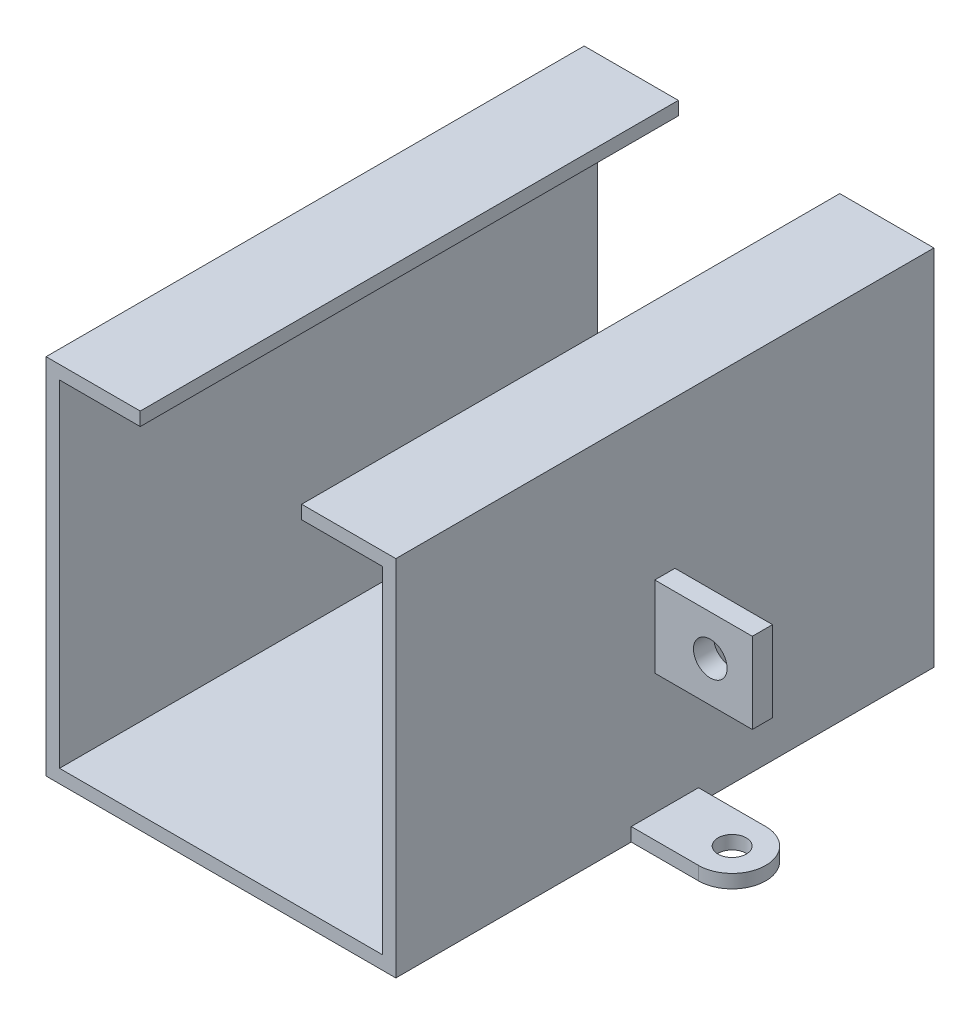
ISO-10303-21;
HEADER;
FILE_DESCRIPTION(('STEP AP214'),'2;1');
FILE_NAME('part.step','',(''),(''),'','','');
FILE_SCHEMA(('AUTOMOTIVE_DESIGN { 1 0 10303 214 1 1 1 1 }'));
ENDSEC;
DATA;
#1=APPLICATION_CONTEXT('core data for automotive mechanical design processes');
#2=APPLICATION_PROTOCOL_DEFINITION('international standard','automotive_design',2000,#1);
#3=PRODUCT_CONTEXT('',#1,'mechanical');
#4=PRODUCT('Part','Part','',(#3));
#5=PRODUCT_RELATED_PRODUCT_CATEGORY('part','',(#4));
#6=PRODUCT_DEFINITION_FORMATION('','',#4);
#7=PRODUCT_DEFINITION_CONTEXT('part definition',#1,'design');
#8=PRODUCT_DEFINITION('design','',#6,#7);
#9=PRODUCT_DEFINITION_SHAPE('','',#8);
#10=(LENGTH_UNIT() NAMED_UNIT(*) SI_UNIT(.MILLI.,.METRE.));
#11=(NAMED_UNIT(*) PLANE_ANGLE_UNIT() SI_UNIT($,.RADIAN.));
#12=(NAMED_UNIT(*) SI_UNIT($,.STERADIAN.) SOLID_ANGLE_UNIT());
#13=UNCERTAINTY_MEASURE_WITH_UNIT(LENGTH_MEASURE(1.E-05),#10,'distance_accuracy_value','');
#14=(GEOMETRIC_REPRESENTATION_CONTEXT(3) GLOBAL_UNCERTAINTY_ASSIGNED_CONTEXT((#13)) GLOBAL_UNIT_ASSIGNED_CONTEXT((#10,
#11,#12)) REPRESENTATION_CONTEXT('',''));
#15=CARTESIAN_POINT('',(0.,0.,0.));
#16=DIRECTION('',(0.,0.,1.));
#17=DIRECTION('',(1.,0.,0.));
#18=AXIS2_PLACEMENT_3D('',#15,#16,#17);
#19=CARTESIAN_POINT('',(50.,-1.99999999999999,80.));
#20=DIRECTION('',(-1.,0.,0.));
#21=DIRECTION('',(0.,0.,1.));
#22=AXIS2_PLACEMENT_3D('',#19,#20,#21);
#23=PLANE('',#22);
#24=DIRECTION('',(0.,-1.,0.));
#25=VECTOR('',#24,1.);
#26=CARTESIAN_POINT('',(50.,0.,45.));
#27=LINE('',#26,#25);
#28=CARTESIAN_POINT('',(50.,0.,45.));
#29=VERTEX_POINT('',#28);
#30=CARTESIAN_POINT('',(50.,-1.99999999999999,45.));
#31=VERTEX_POINT('',#30);
#32=EDGE_CURVE('E345',#29,#31,#27,.T.);
#33=ORIENTED_EDGE('',*,*,#32,.F.);
#34=DIRECTION('',(0.,0.,1.));
#35=VECTOR('',#34,1.);
#36=CARTESIAN_POINT('',(50.,0.,0.));
#37=LINE('',#36,#35);
#38=CARTESIAN_POINT('',(50.,0.,35.));
#39=VERTEX_POINT('',#38);
#40=EDGE_CURVE('E324',#39,#29,#37,.T.);
#41=ORIENTED_EDGE('',*,*,#40,.F.);
#42=DIRECTION('',(0.,-1.,0.));
#43=VECTOR('',#42,1.);
#44=CARTESIAN_POINT('',(50.,0.,35.));
#45=LINE('',#44,#43);
#46=CARTESIAN_POINT('',(50.,-1.99999999999999,35.));
#47=VERTEX_POINT('',#46);
#48=EDGE_CURVE('E342',#39,#47,#45,.T.);
#49=ORIENTED_EDGE('',*,*,#48,.T.);
#50=DIRECTION('',(0.,0.,-1.));
#51=VECTOR('',#50,1.);
#52=CARTESIAN_POINT('',(50.,-1.99999999999999,80.));
#53=LINE('',#52,#51);
#54=CARTESIAN_POINT('',(50.,-1.99999999999999,0.));
#55=VERTEX_POINT('',#54);
#56=EDGE_CURVE('E416',#47,#55,#53,.T.);
#57=ORIENTED_EDGE('',*,*,#56,.T.);
#58=DIRECTION('',(0.,1.,0.));
#59=VECTOR('',#58,1.);
#60=CARTESIAN_POINT('',(50.,-1.99999999999999,0.));
#61=LINE('',#60,#59);
#62=CARTESIAN_POINT('',(50.,52.,0.));
#63=VERTEX_POINT('',#62);
#64=EDGE_CURVE('E393',#55,#63,#61,.T.);
#65=ORIENTED_EDGE('',*,*,#64,.T.);
#66=DIRECTION('',(0.,0.,-1.));
#67=VECTOR('',#66,1.);
#68=CARTESIAN_POINT('',(50.,52.,80.));
#69=LINE('',#68,#67);
#70=CARTESIAN_POINT('',(50.,52.,80.));
#71=VERTEX_POINT('',#70);
#72=EDGE_CURVE('E413',#71,#63,#69,.T.);
#73=ORIENTED_EDGE('',*,*,#72,.F.);
#74=DIRECTION('',(0.,1.,0.));
#75=VECTOR('',#74,1.);
#76=CARTESIAN_POINT('',(50.,-1.99999999999999,80.));
#77=LINE('',#76,#75);
#78=CARTESIAN_POINT('',(50.,-1.99999999999999,80.));
#79=VERTEX_POINT('',#78);
#80=EDGE_CURVE('E365',#79,#71,#77,.T.);
#81=ORIENTED_EDGE('',*,*,#80,.F.);
#82=EDGE_CURVE('E417',#79,#31,#53,.T.);
#83=ORIENTED_EDGE('',*,*,#82,.T.);
#84=EDGE_LOOP('',(#33,#41,#49,#57,#65,#73,#81,#83));
#85=FACE_BOUND('',#84,.T.);
#86=DIRECTION('',(0.,0.,1.));
#87=VECTOR('',#86,1.);
#88=CARTESIAN_POINT('',(50.,30.,0.));
#89=LINE('',#88,#87);
#90=CARTESIAN_POINT('',(50.,30.,38.5));
#91=VERTEX_POINT('',#90);
#92=CARTESIAN_POINT('',(50.,30.,41.5));
#93=VERTEX_POINT('',#92);
#94=EDGE_CURVE('E243',#91,#93,#89,.T.);
#95=ORIENTED_EDGE('',*,*,#94,.F.);
#96=DIRECTION('',(0.,1.,0.));
#97=VECTOR('',#96,1.);
#98=CARTESIAN_POINT('',(50.,0.,38.5));
#99=LINE('',#98,#97);
#100=CARTESIAN_POINT('',(50.,18.,38.5));
#101=VERTEX_POINT('',#100);
#102=EDGE_CURVE('E240',#101,#91,#99,.T.);
#103=ORIENTED_EDGE('',*,*,#102,.F.);
#104=DIRECTION('',(0.,0.,-1.));
#105=VECTOR('',#104,1.);
#106=CARTESIAN_POINT('',(50.,18.,0.));
#107=LINE('',#106,#105);
#108=CARTESIAN_POINT('',(50.,18.,41.5));
#109=VERTEX_POINT('',#108);
#110=EDGE_CURVE('E58',#109,#101,#107,.T.);
#111=ORIENTED_EDGE('',*,*,#110,.F.);
#112=DIRECTION('',(0.,-1.,0.));
#113=VECTOR('',#112,1.);
#114=CARTESIAN_POINT('',(50.,0.,41.5));
#115=LINE('',#114,#113);
#116=EDGE_CURVE('E53',#93,#109,#115,.T.);
#117=ORIENTED_EDGE('',*,*,#116,.F.);
#118=EDGE_LOOP('',(#95,#103,#111,#117));
#119=FACE_BOUND('',#118,.T.);
#120=ADVANCED_FACE('F38',(#85,#119),#23,.F.);
#121=CARTESIAN_POINT('',(-2.,25.,80.));
#122=DIRECTION('',(1.,0.,0.));
#123=DIRECTION('',(0.,1.,0.));
#124=AXIS2_PLACEMENT_3D('',#121,#122,#123);
#125=PLANE('',#124);
#126=DIRECTION('',(0.,0.,1.));
#127=VECTOR('',#126,1.);
#128=CARTESIAN_POINT('',(-2.,30.,0.));
#129=LINE('',#128,#127);
#130=CARTESIAN_POINT('',(-2.,30.,38.5));
#131=VERTEX_POINT('',#130);
#132=CARTESIAN_POINT('',(-2.,30.,41.5));
#133=VERTEX_POINT('',#132);
#134=EDGE_CURVE('E247',#131,#133,#129,.T.);
#135=ORIENTED_EDGE('',*,*,#134,.T.);
#136=DIRECTION('',(0.,-1.,0.));
#137=VECTOR('',#136,1.);
#138=CARTESIAN_POINT('',(-2.,0.,41.5));
#139=LINE('',#138,#137);
#140=CARTESIAN_POINT('',(-2.,18.,41.5));
#141=VERTEX_POINT('',#140);
#142=EDGE_CURVE('E244',#133,#141,#139,.T.);
#143=ORIENTED_EDGE('',*,*,#142,.T.);
#144=DIRECTION('',(0.,0.,-1.));
#145=VECTOR('',#144,1.);
#146=CARTESIAN_POINT('',(-2.,18.,0.));
#147=LINE('',#146,#145);
#148=CARTESIAN_POINT('',(-2.,18.,38.5));
#149=VERTEX_POINT('',#148);
#150=EDGE_CURVE('E257',#141,#149,#147,.T.);
#151=ORIENTED_EDGE('',*,*,#150,.T.);
#152=DIRECTION('',(0.,1.,0.));
#153=VECTOR('',#152,1.);
#154=CARTESIAN_POINT('',(-2.,0.,38.5));
#155=LINE('',#154,#153);
#156=EDGE_CURVE('E269',#149,#131,#155,.T.);
#157=ORIENTED_EDGE('',*,*,#156,.T.);
#158=EDGE_LOOP('',(#135,#143,#151,#157));
#159=FACE_BOUND('',#158,.T.);
#160=DIRECTION('',(0.,-1.,0.));
#161=VECTOR('',#160,1.);
#162=CARTESIAN_POINT('',(-2.,0.,35.));
#163=LINE('',#162,#161);
#164=CARTESIAN_POINT('',(-2.,0.,35.));
#165=VERTEX_POINT('',#164);
#166=CARTESIAN_POINT('',(-2.,-1.99999999999999,35.));
#167=VERTEX_POINT('',#166);
#168=EDGE_CURVE('E312',#165,#167,#163,.T.);
#169=ORIENTED_EDGE('',*,*,#168,.F.);
#170=DIRECTION('',(0.,0.,-1.));
#171=VECTOR('',#170,1.);
#172=CARTESIAN_POINT('',(-2.,0.,0.));
#173=LINE('',#172,#171);
#174=CARTESIAN_POINT('',(-2.,0.,45.));
#175=VERTEX_POINT('',#174);
#176=EDGE_CURVE('E291',#175,#165,#173,.T.);
#177=ORIENTED_EDGE('',*,*,#176,.F.);
#178=DIRECTION('',(0.,-1.,0.));
#179=VECTOR('',#178,1.);
#180=CARTESIAN_POINT('',(-2.,0.,45.));
#181=LINE('',#180,#179);
#182=CARTESIAN_POINT('',(-2.,-1.99999999999999,45.));
#183=VERTEX_POINT('',#182);
#184=EDGE_CURVE('E309',#175,#183,#181,.T.);
#185=ORIENTED_EDGE('',*,*,#184,.T.);
#186=DIRECTION('',(0.,0.,-1.));
#187=VECTOR('',#186,1.);
#188=CARTESIAN_POINT('',(-2.,-1.99999999999999,80.));
#189=LINE('',#188,#187);
#190=CARTESIAN_POINT('',(-2.,-1.99999999999999,80.));
#191=VERTEX_POINT('',#190);
#192=EDGE_CURVE('E421',#191,#183,#189,.T.);
#193=ORIENTED_EDGE('',*,*,#192,.F.);
#194=DIRECTION('',(0.,-1.,0.));
#195=VECTOR('',#194,1.);
#196=CARTESIAN_POINT('',(-2.,25.,80.));
#197=LINE('',#196,#195);
#198=CARTESIAN_POINT('',(-2.,52.,80.));
#199=VERTEX_POINT('',#198);
#200=EDGE_CURVE('E361',#199,#191,#197,.T.);
#201=ORIENTED_EDGE('',*,*,#200,.F.);
#202=DIRECTION('',(0.,0.,-1.));
#203=VECTOR('',#202,1.);
#204=CARTESIAN_POINT('',(-2.,52.,80.));
#205=LINE('',#204,#203);
#206=CARTESIAN_POINT('',(-2.,52.,0.));
#207=VERTEX_POINT('',#206);
#208=EDGE_CURVE('E424',#199,#207,#205,.T.);
#209=ORIENTED_EDGE('',*,*,#208,.T.);
#210=DIRECTION('',(0.,-1.,0.));
#211=VECTOR('',#210,1.);
#212=CARTESIAN_POINT('',(-2.,25.,0.));
#213=LINE('',#212,#211);
#214=CARTESIAN_POINT('',(-2.,-1.99999999999999,0.));
#215=VERTEX_POINT('',#214);
#216=EDGE_CURVE('E387',#207,#215,#213,.T.);
#217=ORIENTED_EDGE('',*,*,#216,.T.);
#218=EDGE_CURVE('E420',#167,#215,#189,.T.);
#219=ORIENTED_EDGE('',*,*,#218,.F.);
#220=EDGE_LOOP('',(#169,#177,#185,#193,#201,#209,#217,#219));
#221=FACE_BOUND('',#220,.T.);
#222=ADVANCED_FACE('F496',(#159,#221),#125,.F.);
#223=CARTESIAN_POINT('',(0.,0.,80.));
#224=DIRECTION('',(0.,-1.,0.));
#225=DIRECTION('',(0.,0.,-1.));
#226=AXIS2_PLACEMENT_3D('',#223,#224,#225);
#227=PLANE('',#226);
#228=DIRECTION('',(-1.,0.,0.));
#229=VECTOR('',#228,1.);
#230=CARTESIAN_POINT('',(0.,0.,0.));
#231=LINE('',#230,#229);
#232=CARTESIAN_POINT('',(48.,0.,0.));
#233=VERTEX_POINT('',#232);
#234=CARTESIAN_POINT('',(0.,0.,0.));
#235=VERTEX_POINT('',#234);
#236=EDGE_CURVE('E341',#233,#235,#231,.T.);
#237=ORIENTED_EDGE('',*,*,#236,.T.);
#238=DIRECTION('',(0.,0.,-1.));
#239=VECTOR('',#238,1.);
#240=CARTESIAN_POINT('',(0.,0.,80.));
#241=LINE('',#240,#239);
#242=CARTESIAN_POINT('',(0.,0.,80.));
#243=VERTEX_POINT('',#242);
#244=EDGE_CURVE('E11',#243,#235,#241,.T.);
#245=ORIENTED_EDGE('',*,*,#244,.F.);
#246=DIRECTION('',(-1.,0.,0.));
#247=VECTOR('',#246,1.);
#248=CARTESIAN_POINT('',(0.,0.,80.));
#249=LINE('',#248,#247);
#250=CARTESIAN_POINT('',(48.,0.,80.));
#251=VERTEX_POINT('',#250);
#252=EDGE_CURVE('E349',#251,#243,#249,.T.);
#253=ORIENTED_EDGE('',*,*,#252,.F.);
#254=DIRECTION('',(0.,0.,-1.));
#255=VECTOR('',#254,1.);
#256=CARTESIAN_POINT('',(48.,0.,80.));
#257=LINE('',#256,#255);
#258=EDGE_CURVE('E375',#251,#233,#257,.T.);
#259=ORIENTED_EDGE('',*,*,#258,.T.);
#260=EDGE_LOOP('',(#237,#245,#253,#259));
#261=FACE_BOUND('',#260,.T.);
#262=ADVANCED_FACE('F40',(#261),#227,.F.);
#263=CARTESIAN_POINT('',(0.,0.,80.));
#264=DIRECTION('',(-1.,0.,0.));
#265=DIRECTION('',(0.,0.,1.));
#266=AXIS2_PLACEMENT_3D('',#263,#264,#265);
#267=PLANE('',#266);
#268=DIRECTION('',(0.,1.,0.));
#269=VECTOR('',#268,1.);
#270=CARTESIAN_POINT('',(0.,0.,0.));
#271=LINE('',#270,#269);
#272=CARTESIAN_POINT('',(0.,50.,0.));
#273=VERTEX_POINT('',#272);
#274=EDGE_CURVE('E378',#235,#273,#271,.T.);
#275=ORIENTED_EDGE('',*,*,#274,.T.);
#276=DIRECTION('',(0.,0.,-1.));
#277=VECTOR('',#276,1.);
#278=CARTESIAN_POINT('',(0.,50.,80.));
#279=LINE('',#278,#277);
#280=CARTESIAN_POINT('',(0.,50.,80.));
#281=VERTEX_POINT('',#280);
#282=EDGE_CURVE('E46',#281,#273,#279,.T.);
#283=ORIENTED_EDGE('',*,*,#282,.F.);
#284=DIRECTION('',(0.,1.,0.));
#285=VECTOR('',#284,1.);
#286=CARTESIAN_POINT('',(0.,0.,80.));
#287=LINE('',#286,#285);
#288=EDGE_CURVE('E352',#243,#281,#287,.T.);
#289=ORIENTED_EDGE('',*,*,#288,.F.);
#290=ORIENTED_EDGE('',*,*,#244,.T.);
#291=EDGE_LOOP('',(#275,#283,#289,#290));
#292=FACE_BOUND('',#291,.T.);
#293=ADVANCED_FACE('F459',(#292),#267,.F.);
#294=CARTESIAN_POINT('',(0.,50.,80.));
#295=DIRECTION('',(0.,1.,0.));
#296=DIRECTION('',(0.,0.,1.));
#297=AXIS2_PLACEMENT_3D('',#294,#295,#296);
#298=PLANE('',#297);
#299=DIRECTION('',(1.,0.,0.));
#300=VECTOR('',#299,1.);
#301=CARTESIAN_POINT('',(0.,50.,0.));
#302=LINE('',#301,#300);
#303=CARTESIAN_POINT('',(12.,50.,0.));
#304=VERTEX_POINT('',#303);
#305=EDGE_CURVE('E380',#273,#304,#302,.T.);
#306=ORIENTED_EDGE('',*,*,#305,.T.);
#307=DIRECTION('',(0.,0.,-1.));
#308=VECTOR('',#307,1.);
#309=CARTESIAN_POINT('',(12.,50.,80.));
#310=LINE('',#309,#308);
#311=CARTESIAN_POINT('',(12.,50.,80.));
#312=VERTEX_POINT('',#311);
#313=EDGE_CURVE('E430',#312,#304,#310,.T.);
#314=ORIENTED_EDGE('',*,*,#313,.F.);
#315=DIRECTION('',(1.,0.,0.));
#316=VECTOR('',#315,1.);
#317=CARTESIAN_POINT('',(0.,50.,80.));
#318=LINE('',#317,#316);
#319=EDGE_CURVE('E355',#281,#312,#318,.T.);
#320=ORIENTED_EDGE('',*,*,#319,.F.);
#321=ORIENTED_EDGE('',*,*,#282,.T.);
#322=EDGE_LOOP('',(#306,#314,#320,#321));
#323=FACE_BOUND('',#322,.T.);
#324=ADVANCED_FACE('F437',(#323),#298,.F.);
#325=CARTESIAN_POINT('',(12.,52.,80.));
#326=DIRECTION('',(-1.,0.,0.));
#327=DIRECTION('',(0.,0.,1.));
#328=AXIS2_PLACEMENT_3D('',#325,#326,#327);
#329=PLANE('',#328);
#330=DIRECTION('',(0.,1.,0.));
#331=VECTOR('',#330,1.);
#332=CARTESIAN_POINT('',(12.,52.,0.));
#333=LINE('',#332,#331);
#334=CARTESIAN_POINT('',(12.,52.,0.));
#335=VERTEX_POINT('',#334);
#336=EDGE_CURVE('E382',#304,#335,#333,.T.);
#337=ORIENTED_EDGE('',*,*,#336,.T.);
#338=DIRECTION('',(0.,0.,-1.));
#339=VECTOR('',#338,1.);
#340=CARTESIAN_POINT('',(12.,52.,80.));
#341=LINE('',#340,#339);
#342=CARTESIAN_POINT('',(12.,52.,80.));
#343=VERTEX_POINT('',#342);
#344=EDGE_CURVE('E427',#343,#335,#341,.T.);
#345=ORIENTED_EDGE('',*,*,#344,.F.);
#346=DIRECTION('',(0.,1.,0.));
#347=VECTOR('',#346,1.);
#348=CARTESIAN_POINT('',(12.,52.,80.));
#349=LINE('',#348,#347);
#350=EDGE_CURVE('E357',#312,#343,#349,.T.);
#351=ORIENTED_EDGE('',*,*,#350,.F.);
#352=ORIENTED_EDGE('',*,*,#313,.T.);
#353=EDGE_LOOP('',(#337,#345,#351,#352));
#354=FACE_BOUND('',#353,.T.);
#355=ADVANCED_FACE('F447',(#354),#329,.F.);
#356=CARTESIAN_POINT('',(-2.,52.,80.));
#357=DIRECTION('',(0.,-1.,0.));
#358=DIRECTION('',(0.,0.,-1.));
#359=AXIS2_PLACEMENT_3D('',#356,#357,#358);
#360=PLANE('',#359);
#361=DIRECTION('',(-1.,0.,0.));
#362=VECTOR('',#361,1.);
#363=CARTESIAN_POINT('',(-2.,52.,0.));
#364=LINE('',#363,#362);
#365=EDGE_CURVE('E384',#335,#207,#364,.T.);
#366=ORIENTED_EDGE('',*,*,#365,.T.);
#367=ORIENTED_EDGE('',*,*,#208,.F.);
#368=DIRECTION('',(-1.,0.,0.));
#369=VECTOR('',#368,1.);
#370=CARTESIAN_POINT('',(-2.,52.,80.));
#371=LINE('',#370,#369);
#372=EDGE_CURVE('E359',#343,#199,#371,.T.);
#373=ORIENTED_EDGE('',*,*,#372,.F.);
#374=ORIENTED_EDGE('',*,*,#344,.T.);
#375=EDGE_LOOP('',(#366,#367,#373,#374));
#376=FACE_BOUND('',#375,.T.);
#377=ADVANCED_FACE('F451',(#376),#360,.F.);
#378=CARTESIAN_POINT('',(-2.,-1.99999999999999,80.));
#379=DIRECTION('',(0.,1.,0.));
#380=DIRECTION('',(0.,0.,1.));
#381=AXIS2_PLACEMENT_3D('',#378,#379,#380);
#382=PLANE('',#381);
#383=DIRECTION('',(1.,0.,0.));
#384=VECTOR('',#383,1.);
#385=CARTESIAN_POINT('',(-2.,-1.99999999999999,0.));
#386=LINE('',#385,#384);
#387=EDGE_CURVE('E390',#215,#55,#386,.T.);
#388=ORIENTED_EDGE('',*,*,#387,.T.);
#389=ORIENTED_EDGE('',*,*,#56,.F.);
#390=DIRECTION('',(1.,0.,0.));
#391=VECTOR('',#390,1.);
#392=CARTESIAN_POINT('',(0.,-1.99999999999999,35.));
#393=LINE('',#392,#391);
#394=CARTESIAN_POINT('',(60.,-1.99999999999999,35.));
#395=VERTEX_POINT('',#394);
#396=EDGE_CURVE('E320',#47,#395,#393,.T.);
#397=ORIENTED_EDGE('',*,*,#396,.T.);
#398=CARTESIAN_POINT('',(60.,-1.99999999999999,40.));
#399=DIRECTION('',(0.,-1.,0.));
#400=DIRECTION('',(0.,0.,-1.));
#401=AXIS2_PLACEMENT_3D('',#398,#399,#400);
#402=CIRCLE('',#401,5.);
#403=CARTESIAN_POINT('',(60.,-1.99999999999999,45.));
#404=VERTEX_POINT('',#403);
#405=EDGE_CURVE('E332',#404,#395,#402,.F.);
#406=ORIENTED_EDGE('',*,*,#405,.F.);
#407=DIRECTION('',(1.,0.,0.));
#408=VECTOR('',#407,1.);
#409=CARTESIAN_POINT('',(0.,-1.99999999999999,45.));
#410=LINE('',#409,#408);
#411=EDGE_CURVE('E335',#31,#404,#410,.T.);
#412=ORIENTED_EDGE('',*,*,#411,.F.);
#413=ORIENTED_EDGE('',*,*,#82,.F.);
#414=DIRECTION('',(1.,0.,0.));
#415=VECTOR('',#414,1.);
#416=CARTESIAN_POINT('',(-2.,-1.99999999999999,80.));
#417=LINE('',#416,#415);
#418=EDGE_CURVE('E363',#191,#79,#417,.T.);
#419=ORIENTED_EDGE('',*,*,#418,.F.);
#420=ORIENTED_EDGE('',*,*,#192,.T.);
#421=DIRECTION('',(-1.,0.,0.));
#422=VECTOR('',#421,1.);
#423=CARTESIAN_POINT('',(0.,-1.99999999999999,45.));
#424=LINE('',#423,#422);
#425=CARTESIAN_POINT('',(-12.,-1.99999999999999,45.));
#426=VERTEX_POINT('',#425);
#427=EDGE_CURVE('E287',#183,#426,#424,.T.);
#428=ORIENTED_EDGE('',*,*,#427,.T.);
#429=CARTESIAN_POINT('',(-12.,-1.99999999999999,40.));
#430=DIRECTION('',(0.,-1.,0.));
#431=DIRECTION('',(0.,0.,-1.));
#432=AXIS2_PLACEMENT_3D('',#429,#430,#431);
#433=CIRCLE('',#432,5.);
#434=CARTESIAN_POINT('',(-12.,-1.99999999999999,35.));
#435=VERTEX_POINT('',#434);
#436=EDGE_CURVE('E299',#435,#426,#433,.F.);
#437=ORIENTED_EDGE('',*,*,#436,.F.);
#438=DIRECTION('',(-1.,0.,0.));
#439=VECTOR('',#438,1.);
#440=CARTESIAN_POINT('',(0.,-1.99999999999999,35.));
#441=LINE('',#440,#439);
#442=EDGE_CURVE('E302',#167,#435,#441,.T.);
#443=ORIENTED_EDGE('',*,*,#442,.F.);
#444=ORIENTED_EDGE('',*,*,#218,.T.);
#445=EDGE_LOOP('',(#388,#389,#397,#406,#412,#413,#419,#420,#428,#437,#443,#444));
#446=FACE_BOUND('',#445,.T.);
#447=CARTESIAN_POINT('',(60.,-1.99999999999999,40.));
#448=DIRECTION('',(0.,-1.,0.));
#449=DIRECTION('',(0.,0.,-1.));
#450=AXIS2_PLACEMENT_3D('',#447,#448,#449);
#451=CIRCLE('',#450,2.1);
#452=CARTESIAN_POINT('',(60.,-1.99999999999999,37.9));
#453=VERTEX_POINT('',#452);
#454=EDGE_CURVE('E308',#453,#453,#451,.T.);
#455=ORIENTED_EDGE('',*,*,#454,.F.);
#456=EDGE_LOOP('',(#455));
#457=FACE_BOUND('',#456,.T.);
#458=CARTESIAN_POINT('',(-12.,-1.99999999999999,40.));
#459=DIRECTION('',(0.,-1.,0.));
#460=DIRECTION('',(0.,0.,-1.));
#461=AXIS2_PLACEMENT_3D('',#458,#459,#460);
#462=CIRCLE('',#461,2.1);
#463=CARTESIAN_POINT('',(-12.,-1.99999999999999,37.9));
#464=VERTEX_POINT('',#463);
#465=EDGE_CURVE('E282',#464,#464,#462,.T.);
#466=ORIENTED_EDGE('',*,*,#465,.F.);
#467=EDGE_LOOP('',(#466));
#468=FACE_BOUND('',#467,.T.);
#469=ADVANCED_FACE('F490',(#446,#457,#468),#382,.F.);
#470=CARTESIAN_POINT('',(50.,52.,80.));
#471=DIRECTION('',(0.,-1.,0.));
#472=DIRECTION('',(0.,0.,-1.));
#473=AXIS2_PLACEMENT_3D('',#470,#471,#472);
#474=PLANE('',#473);
#475=DIRECTION('',(-1.,0.,0.));
#476=VECTOR('',#475,1.);
#477=CARTESIAN_POINT('',(50.,52.,0.));
#478=LINE('',#477,#476);
#479=CARTESIAN_POINT('',(36.,52.,0.));
#480=VERTEX_POINT('',#479);
#481=EDGE_CURVE('E395',#63,#480,#478,.T.);
#482=ORIENTED_EDGE('',*,*,#481,.T.);
#483=DIRECTION('',(0.,0.,-1.));
#484=VECTOR('',#483,1.);
#485=CARTESIAN_POINT('',(36.,52.,80.));
#486=LINE('',#485,#484);
#487=CARTESIAN_POINT('',(36.,52.,80.));
#488=VERTEX_POINT('',#487);
#489=EDGE_CURVE('E410',#488,#480,#486,.T.);
#490=ORIENTED_EDGE('',*,*,#489,.F.);
#491=DIRECTION('',(-1.,0.,0.));
#492=VECTOR('',#491,1.);
#493=CARTESIAN_POINT('',(50.,52.,80.));
#494=LINE('',#493,#492);
#495=EDGE_CURVE('E367',#71,#488,#494,.T.);
#496=ORIENTED_EDGE('',*,*,#495,.F.);
#497=ORIENTED_EDGE('',*,*,#72,.T.);
#498=EDGE_LOOP('',(#482,#490,#496,#497));
#499=FACE_BOUND('',#498,.T.);
#500=ADVANCED_FACE('F481',(#499),#474,.F.);
#501=CARTESIAN_POINT('',(36.,52.,80.));
#502=DIRECTION('',(1.,0.,0.));
#503=DIRECTION('',(0.,0.,-1.));
#504=AXIS2_PLACEMENT_3D('',#501,#502,#503);
#505=PLANE('',#504);
#506=DIRECTION('',(0.,-1.,0.));
#507=VECTOR('',#506,1.);
#508=CARTESIAN_POINT('',(36.,52.,0.));
#509=LINE('',#508,#507);
#510=CARTESIAN_POINT('',(36.,50.,0.));
#511=VERTEX_POINT('',#510);
#512=EDGE_CURVE('E397',#480,#511,#509,.T.);
#513=ORIENTED_EDGE('',*,*,#512,.T.);
#514=DIRECTION('',(0.,0.,-1.));
#515=VECTOR('',#514,1.);
#516=CARTESIAN_POINT('',(36.,50.,80.));
#517=LINE('',#516,#515);
#518=CARTESIAN_POINT('',(36.,50.,80.));
#519=VERTEX_POINT('',#518);
#520=EDGE_CURVE('E407',#519,#511,#517,.T.);
#521=ORIENTED_EDGE('',*,*,#520,.F.);
#522=DIRECTION('',(0.,-1.,0.));
#523=VECTOR('',#522,1.);
#524=CARTESIAN_POINT('',(36.,52.,80.));
#525=LINE('',#524,#523);
#526=EDGE_CURVE('E369',#488,#519,#525,.T.);
#527=ORIENTED_EDGE('',*,*,#526,.F.);
#528=ORIENTED_EDGE('',*,*,#489,.T.);
#529=EDGE_LOOP('',(#513,#521,#527,#528));
#530=FACE_BOUND('',#529,.T.);
#531=ADVANCED_FACE('F475',(#530),#505,.F.);
#532=CARTESIAN_POINT('',(48.,50.,80.));
#533=DIRECTION('',(0.,1.,0.));
#534=DIRECTION('',(0.,0.,1.));
#535=AXIS2_PLACEMENT_3D('',#532,#533,#534);
#536=PLANE('',#535);
#537=DIRECTION('',(1.,0.,0.));
#538=VECTOR('',#537,1.);
#539=CARTESIAN_POINT('',(48.,50.,0.));
#540=LINE('',#539,#538);
#541=CARTESIAN_POINT('',(48.,50.,0.));
#542=VERTEX_POINT('',#541);
#543=EDGE_CURVE('E399',#511,#542,#540,.T.);
#544=ORIENTED_EDGE('',*,*,#543,.T.);
#545=DIRECTION('',(0.,0.,-1.));
#546=VECTOR('',#545,1.);
#547=CARTESIAN_POINT('',(48.,50.,80.));
#548=LINE('',#547,#546);
#549=CARTESIAN_POINT('',(48.,50.,80.));
#550=VERTEX_POINT('',#549);
#551=EDGE_CURVE('E404',#550,#542,#548,.T.);
#552=ORIENTED_EDGE('',*,*,#551,.F.);
#553=DIRECTION('',(1.,0.,0.));
#554=VECTOR('',#553,1.);
#555=CARTESIAN_POINT('',(48.,50.,80.));
#556=LINE('',#555,#554);
#557=EDGE_CURVE('E371',#519,#550,#556,.T.);
#558=ORIENTED_EDGE('',*,*,#557,.F.);
#559=ORIENTED_EDGE('',*,*,#520,.T.);
#560=EDGE_LOOP('',(#544,#552,#558,#559));
#561=FACE_BOUND('',#560,.T.);
#562=ADVANCED_FACE('F471',(#561),#536,.F.);
#563=CARTESIAN_POINT('',(48.,0.,80.));
#564=DIRECTION('',(1.,0.,0.));
#565=DIRECTION('',(0.,0.,-1.));
#566=AXIS2_PLACEMENT_3D('',#563,#564,#565);
#567=PLANE('',#566);
#568=DIRECTION('',(0.,-1.,0.));
#569=VECTOR('',#568,1.);
#570=CARTESIAN_POINT('',(48.,0.,0.));
#571=LINE('',#570,#569);
#572=EDGE_CURVE('E353',#542,#233,#571,.T.);
#573=ORIENTED_EDGE('',*,*,#572,.T.);
#574=ORIENTED_EDGE('',*,*,#258,.F.);
#575=DIRECTION('',(0.,-1.,0.));
#576=VECTOR('',#575,1.);
#577=CARTESIAN_POINT('',(48.,0.,80.));
#578=LINE('',#577,#576);
#579=EDGE_CURVE('E373',#550,#251,#578,.T.);
#580=ORIENTED_EDGE('',*,*,#579,.F.);
#581=ORIENTED_EDGE('',*,*,#551,.T.);
#582=EDGE_LOOP('',(#573,#574,#580,#581));
#583=FACE_BOUND('',#582,.T.);
#584=ADVANCED_FACE('F466',(#583),#567,.F.);
#585=CARTESIAN_POINT('',(0.,0.,80.));
#586=DIRECTION('',(0.,0.,1.));
#587=DIRECTION('',(1.,0.,0.));
#588=AXIS2_PLACEMENT_3D('',#585,#586,#587);
#589=PLANE('',#588);
#590=ORIENTED_EDGE('',*,*,#252,.T.);
#591=ORIENTED_EDGE('',*,*,#288,.T.);
#592=ORIENTED_EDGE('',*,*,#319,.T.);
#593=ORIENTED_EDGE('',*,*,#350,.T.);
#594=ORIENTED_EDGE('',*,*,#372,.T.);
#595=ORIENTED_EDGE('',*,*,#200,.T.);
#596=ORIENTED_EDGE('',*,*,#418,.T.);
#597=ORIENTED_EDGE('',*,*,#80,.T.);
#598=ORIENTED_EDGE('',*,*,#495,.T.);
#599=ORIENTED_EDGE('',*,*,#526,.T.);
#600=ORIENTED_EDGE('',*,*,#557,.T.);
#601=ORIENTED_EDGE('',*,*,#579,.T.);
#602=EDGE_LOOP('',(#590,#591,#592,#593,#594,#595,#596,#597,#598,#599,#600,#601));
#603=FACE_BOUND('',#602,.T.);
#604=ADVANCED_FACE('F455',(#603),#589,.T.);
#605=CARTESIAN_POINT('',(0.,0.,0.));
#606=DIRECTION('',(0.,0.,1.));
#607=DIRECTION('',(1.,0.,0.));
#608=AXIS2_PLACEMENT_3D('',#605,#606,#607);
#609=PLANE('',#608);
#610=ORIENTED_EDGE('',*,*,#236,.F.);
#611=ORIENTED_EDGE('',*,*,#572,.F.);
#612=ORIENTED_EDGE('',*,*,#543,.F.);
#613=ORIENTED_EDGE('',*,*,#512,.F.);
#614=ORIENTED_EDGE('',*,*,#481,.F.);
#615=ORIENTED_EDGE('',*,*,#64,.F.);
#616=ORIENTED_EDGE('',*,*,#387,.F.);
#617=ORIENTED_EDGE('',*,*,#216,.F.);
#618=ORIENTED_EDGE('',*,*,#365,.F.);
#619=ORIENTED_EDGE('',*,*,#336,.F.);
#620=ORIENTED_EDGE('',*,*,#305,.F.);
#621=ORIENTED_EDGE('',*,*,#274,.F.);
#622=EDGE_LOOP('',(#610,#611,#612,#613,#614,#615,#616,#617,#618,#619,#620,#621));
#623=FACE_BOUND('',#622,.T.);
#624=ADVANCED_FACE('F443',(#623),#609,.F.);
#625=CARTESIAN_POINT('',(60.,0.,40.));
#626=DIRECTION('',(0.,-1.,0.));
#627=DIRECTION('',(0.,0.,-1.));
#628=AXIS2_PLACEMENT_3D('',#625,#626,#627);
#629=CYLINDRICAL_SURFACE('',#628,5.);
#630=ORIENTED_EDGE('',*,*,#405,.T.);
#631=DIRECTION('',(0.,-1.,0.));
#632=VECTOR('',#631,1.);
#633=CARTESIAN_POINT('',(60.,0.,35.));
#634=LINE('',#633,#632);
#635=CARTESIAN_POINT('',(60.,0.,35.));
#636=VERTEX_POINT('',#635);
#637=EDGE_CURVE('E339',#636,#395,#634,.T.);
#638=ORIENTED_EDGE('',*,*,#637,.F.);
#639=CARTESIAN_POINT('',(60.,0.,40.));
#640=DIRECTION('',(0.,-1.,0.));
#641=DIRECTION('',(0.,0.,-1.));
#642=AXIS2_PLACEMENT_3D('',#639,#640,#641);
#643=CIRCLE('',#642,5.);
#644=CARTESIAN_POINT('',(60.,0.,45.));
#645=VERTEX_POINT('',#644);
#646=EDGE_CURVE('E319',#645,#636,#643,.F.);
#647=ORIENTED_EDGE('',*,*,#646,.F.);
#648=DIRECTION('',(0.,-1.,0.));
#649=VECTOR('',#648,1.);
#650=CARTESIAN_POINT('',(60.,0.,45.));
#651=LINE('',#650,#649);
#652=EDGE_CURVE('E329',#645,#404,#651,.T.);
#653=ORIENTED_EDGE('',*,*,#652,.T.);
#654=EDGE_LOOP('',(#630,#638,#647,#653));
#655=FACE_BOUND('',#654,.T.);
#656=ADVANCED_FACE('F514',(#655),#629,.T.);
#657=CARTESIAN_POINT('',(0.,0.,35.));
#658=DIRECTION('',(0.,0.,-1.));
#659=DIRECTION('',(-1.,0.,0.));
#660=AXIS2_PLACEMENT_3D('',#657,#658,#659);
#661=PLANE('',#660);
#662=ORIENTED_EDGE('',*,*,#396,.F.);
#663=ORIENTED_EDGE('',*,*,#48,.F.);
#664=DIRECTION('',(1.,0.,0.));
#665=VECTOR('',#664,1.);
#666=CARTESIAN_POINT('',(0.,0.,35.));
#667=LINE('',#666,#665);
#668=EDGE_CURVE('E326',#39,#636,#667,.T.);
#669=ORIENTED_EDGE('',*,*,#668,.T.);
#670=ORIENTED_EDGE('',*,*,#637,.T.);
#671=EDGE_LOOP('',(#662,#663,#669,#670));
#672=FACE_BOUND('',#671,.T.);
#673=ADVANCED_FACE('F512',(#672),#661,.T.);
#674=CARTESIAN_POINT('',(60.,0.,40.));
#675=DIRECTION('',(0.,-1.,0.));
#676=DIRECTION('',(0.,0.,-1.));
#677=AXIS2_PLACEMENT_3D('',#674,#675,#676);
#678=CYLINDRICAL_SURFACE('',#677,2.1);
#679=CARTESIAN_POINT('',(60.,0.,40.));
#680=DIRECTION('',(0.,-1.,0.));
#681=DIRECTION('',(0.,0.,-1.));
#682=AXIS2_PLACEMENT_3D('',#679,#680,#681);
#683=CIRCLE('',#682,2.1);
#684=CARTESIAN_POINT('',(60.,0.,37.9));
#685=VERTEX_POINT('',#684);
#686=EDGE_CURVE('E316',#685,#685,#683,.T.);
#687=ORIENTED_EDGE('',*,*,#686,.F.);
#688=EDGE_LOOP('',(#687));
#689=FACE_BOUND('',#688,.T.);
#690=ORIENTED_EDGE('',*,*,#454,.T.);
#691=EDGE_LOOP('',(#690));
#692=FACE_BOUND('',#691,.T.);
#693=ADVANCED_FACE('F521',(#689,#692),#678,.F.);
#694=CARTESIAN_POINT('',(0.,0.,45.));
#695=DIRECTION('',(0.,0.,-1.));
#696=DIRECTION('',(-1.,0.,0.));
#697=AXIS2_PLACEMENT_3D('',#694,#695,#696);
#698=PLANE('',#697);
#699=ORIENTED_EDGE('',*,*,#411,.T.);
#700=ORIENTED_EDGE('',*,*,#652,.F.);
#701=DIRECTION('',(1.,0.,0.));
#702=VECTOR('',#701,1.);
#703=CARTESIAN_POINT('',(0.,0.,45.));
#704=LINE('',#703,#702);
#705=EDGE_CURVE('E322',#29,#645,#704,.T.);
#706=ORIENTED_EDGE('',*,*,#705,.F.);
#707=ORIENTED_EDGE('',*,*,#32,.T.);
#708=EDGE_LOOP('',(#699,#700,#706,#707));
#709=FACE_BOUND('',#708,.T.);
#710=ADVANCED_FACE('F504',(#709),#698,.F.);
#711=CARTESIAN_POINT('',(0.,0.,0.));
#712=DIRECTION('',(0.,-1.,0.));
#713=DIRECTION('',(0.,0.,-1.));
#714=AXIS2_PLACEMENT_3D('',#711,#712,#713);
#715=PLANE('',#714);
#716=ORIENTED_EDGE('',*,*,#686,.T.);
#717=EDGE_LOOP('',(#716));
#718=FACE_BOUND('',#717,.T.);
#719=ORIENTED_EDGE('',*,*,#646,.T.);
#720=ORIENTED_EDGE('',*,*,#668,.F.);
#721=ORIENTED_EDGE('',*,*,#40,.T.);
#722=ORIENTED_EDGE('',*,*,#705,.T.);
#723=EDGE_LOOP('',(#719,#720,#721,#722));
#724=FACE_BOUND('',#723,.T.);
#725=ADVANCED_FACE('F508',(#718,#724),#715,.F.);
#726=CARTESIAN_POINT('',(-12.,0.,40.));
#727=DIRECTION('',(0.,-1.,0.));
#728=DIRECTION('',(0.,0.,-1.));
#729=AXIS2_PLACEMENT_3D('',#726,#727,#728);
#730=CYLINDRICAL_SURFACE('',#729,5.);
#731=ORIENTED_EDGE('',*,*,#436,.T.);
#732=DIRECTION('',(0.,-1.,0.));
#733=VECTOR('',#732,1.);
#734=CARTESIAN_POINT('',(-12.,0.,45.));
#735=LINE('',#734,#733);
#736=CARTESIAN_POINT('',(-12.,0.,45.));
#737=VERTEX_POINT('',#736);
#738=EDGE_CURVE('E306',#737,#426,#735,.T.);
#739=ORIENTED_EDGE('',*,*,#738,.F.);
#740=CARTESIAN_POINT('',(-12.,0.,40.));
#741=DIRECTION('',(0.,-1.,0.));
#742=DIRECTION('',(0.,0.,-1.));
#743=AXIS2_PLACEMENT_3D('',#740,#741,#742);
#744=CIRCLE('',#743,5.);
#745=CARTESIAN_POINT('',(-12.,0.,35.));
#746=VERTEX_POINT('',#745);
#747=EDGE_CURVE('E286',#746,#737,#744,.F.);
#748=ORIENTED_EDGE('',*,*,#747,.F.);
#749=DIRECTION('',(0.,-1.,0.));
#750=VECTOR('',#749,1.);
#751=CARTESIAN_POINT('',(-12.,0.,35.));
#752=LINE('',#751,#750);
#753=EDGE_CURVE('E296',#746,#435,#752,.T.);
#754=ORIENTED_EDGE('',*,*,#753,.T.);
#755=EDGE_LOOP('',(#731,#739,#748,#754));
#756=FACE_BOUND('',#755,.T.);
#757=ADVANCED_FACE('F698',(#756),#730,.T.);
#758=CARTESIAN_POINT('',(0.,0.,45.));
#759=DIRECTION('',(0.,0.,1.));
#760=DIRECTION('',(1.,0.,0.));
#761=AXIS2_PLACEMENT_3D('',#758,#759,#760);
#762=PLANE('',#761);
#763=ORIENTED_EDGE('',*,*,#427,.F.);
#764=ORIENTED_EDGE('',*,*,#184,.F.);
#765=DIRECTION('',(-1.,0.,0.));
#766=VECTOR('',#765,1.);
#767=CARTESIAN_POINT('',(0.,0.,45.));
#768=LINE('',#767,#766);
#769=EDGE_CURVE('E293',#175,#737,#768,.T.);
#770=ORIENTED_EDGE('',*,*,#769,.T.);
#771=ORIENTED_EDGE('',*,*,#738,.T.);
#772=EDGE_LOOP('',(#763,#764,#770,#771));
#773=FACE_BOUND('',#772,.T.);
#774=ADVANCED_FACE('F694',(#773),#762,.T.);
#775=CARTESIAN_POINT('',(-12.,0.,40.));
#776=DIRECTION('',(0.,-1.,0.));
#777=DIRECTION('',(0.,0.,-1.));
#778=AXIS2_PLACEMENT_3D('',#775,#776,#777);
#779=CYLINDRICAL_SURFACE('',#778,2.1);
#780=CARTESIAN_POINT('',(-12.,0.,40.));
#781=DIRECTION('',(0.,-1.,0.));
#782=DIRECTION('',(0.,0.,-1.));
#783=AXIS2_PLACEMENT_3D('',#780,#781,#782);
#784=CIRCLE('',#783,2.1);
#785=CARTESIAN_POINT('',(-12.,0.,37.9));
#786=VERTEX_POINT('',#785);
#787=EDGE_CURVE('E283',#786,#786,#784,.T.);
#788=ORIENTED_EDGE('',*,*,#787,.F.);
#789=EDGE_LOOP('',(#788));
#790=FACE_BOUND('',#789,.T.);
#791=ORIENTED_EDGE('',*,*,#465,.T.);
#792=EDGE_LOOP('',(#791));
#793=FACE_BOUND('',#792,.T.);
#794=ADVANCED_FACE('F697',(#790,#793),#779,.F.);
#795=CARTESIAN_POINT('',(0.,0.,35.));
#796=DIRECTION('',(0.,0.,1.));
#797=DIRECTION('',(1.,0.,0.));
#798=AXIS2_PLACEMENT_3D('',#795,#796,#797);
#799=PLANE('',#798);
#800=ORIENTED_EDGE('',*,*,#442,.T.);
#801=ORIENTED_EDGE('',*,*,#753,.F.);
#802=DIRECTION('',(-1.,0.,0.));
#803=VECTOR('',#802,1.);
#804=CARTESIAN_POINT('',(0.,0.,35.));
#805=LINE('',#804,#803);
#806=EDGE_CURVE('E289',#165,#746,#805,.T.);
#807=ORIENTED_EDGE('',*,*,#806,.F.);
#808=ORIENTED_EDGE('',*,*,#168,.T.);
#809=EDGE_LOOP('',(#800,#801,#807,#808));
#810=FACE_BOUND('',#809,.T.);
#811=ADVANCED_FACE('F692',(#810),#799,.F.);
#812=CARTESIAN_POINT('',(0.,0.,0.));
#813=DIRECTION('',(0.,-1.,0.));
#814=DIRECTION('',(0.,0.,-1.));
#815=AXIS2_PLACEMENT_3D('',#812,#813,#814);
#816=PLANE('',#815);
#817=ORIENTED_EDGE('',*,*,#787,.T.);
#818=EDGE_LOOP('',(#817));
#819=FACE_BOUND('',#818,.T.);
#820=ORIENTED_EDGE('',*,*,#747,.T.);
#821=ORIENTED_EDGE('',*,*,#769,.F.);
#822=ORIENTED_EDGE('',*,*,#176,.T.);
#823=ORIENTED_EDGE('',*,*,#806,.T.);
#824=EDGE_LOOP('',(#820,#821,#822,#823));
#825=FACE_BOUND('',#824,.T.);
#826=ADVANCED_FACE('F561',(#819,#825),#816,.F.);
#827=CARTESIAN_POINT('',(-16.5,0.,41.5));
#828=DIRECTION('',(0.,0.,1.));
#829=DIRECTION('',(1.,0.,0.));
#830=AXIS2_PLACEMENT_3D('',#827,#828,#829);
#831=PLANE('',#830);
#832=CARTESIAN_POINT('',(-10.2500000000001,23.9999999999999,41.5));
#833=DIRECTION('',(0.,0.,1.));
#834=DIRECTION('',(1.,0.,0.));
#835=AXIS2_PLACEMENT_3D('',#832,#833,#834);
#836=CIRCLE('',#835,2.5);
#837=CARTESIAN_POINT('',(-7.7500000000001,23.9999999999999,41.5));
#838=VERTEX_POINT('',#837);
#839=EDGE_CURVE('E864',#838,#838,#836,.T.);
#840=ORIENTED_EDGE('',*,*,#839,.F.);
#841=EDGE_LOOP('',(#840));
#842=FACE_BOUND('',#841,.T.);
#843=ORIENTED_EDGE('',*,*,#142,.F.);
#844=DIRECTION('',(1.,0.,0.));
#845=VECTOR('',#844,1.);
#846=CARTESIAN_POINT('',(-16.5,30.,41.5));
#847=LINE('',#846,#845);
#848=CARTESIAN_POINT('',(-16.5,30.,41.5));
#849=VERTEX_POINT('',#848);
#850=EDGE_CURVE('E280',#849,#133,#847,.T.);
#851=ORIENTED_EDGE('',*,*,#850,.F.);
#852=DIRECTION('',(0.,-1.,0.));
#853=VECTOR('',#852,1.);
#854=CARTESIAN_POINT('',(-16.5,0.,41.5));
#855=LINE('',#854,#853);
#856=CARTESIAN_POINT('',(-16.5,18.,41.5));
#857=VERTEX_POINT('',#856);
#858=EDGE_CURVE('E253',#849,#857,#855,.T.);
#859=ORIENTED_EDGE('',*,*,#858,.T.);
#860=DIRECTION('',(1.,0.,0.));
#861=VECTOR('',#860,1.);
#862=CARTESIAN_POINT('',(-16.5,18.,41.5));
#863=LINE('',#862,#861);
#864=EDGE_CURVE('E265',#857,#141,#863,.T.);
#865=ORIENTED_EDGE('',*,*,#864,.T.);
#866=EDGE_LOOP('',(#843,#851,#859,#865));
#867=FACE_BOUND('',#866,.T.);
#868=ADVANCED_FACE('F572',(#842,#867),#831,.T.);
#869=CARTESIAN_POINT('',(-16.5,30.,0.));
#870=DIRECTION('',(0.,1.,0.));
#871=DIRECTION('',(-1.,0.,0.));
#872=AXIS2_PLACEMENT_3D('',#869,#870,#871);
#873=PLANE('',#872);
#874=ORIENTED_EDGE('',*,*,#134,.F.);
#875=DIRECTION('',(1.,0.,0.));
#876=VECTOR('',#875,1.);
#877=CARTESIAN_POINT('',(-16.5,30.,38.5));
#878=LINE('',#877,#876);
#879=CARTESIAN_POINT('',(-16.5,30.,38.5));
#880=VERTEX_POINT('',#879);
#881=EDGE_CURVE('E278',#880,#131,#878,.T.);
#882=ORIENTED_EDGE('',*,*,#881,.F.);
#883=DIRECTION('',(0.,0.,1.));
#884=VECTOR('',#883,1.);
#885=CARTESIAN_POINT('',(-16.5,30.,0.));
#886=LINE('',#885,#884);
#887=EDGE_CURVE('E256',#880,#849,#886,.T.);
#888=ORIENTED_EDGE('',*,*,#887,.T.);
#889=ORIENTED_EDGE('',*,*,#850,.T.);
#890=EDGE_LOOP('',(#874,#882,#888,#889));
#891=FACE_BOUND('',#890,.T.);
#892=ADVANCED_FACE('F566',(#891),#873,.T.);
#893=CARTESIAN_POINT('',(-16.5,0.,38.5));
#894=DIRECTION('',(0.,0.,-1.));
#895=DIRECTION('',(-1.,0.,0.));
#896=AXIS2_PLACEMENT_3D('',#893,#894,#895);
#897=PLANE('',#896);
#898=CARTESIAN_POINT('',(-10.2500000000001,23.9999999999999,38.5));
#899=DIRECTION('',(0.,0.,-1.));
#900=DIRECTION('',(-1.,0.,0.));
#901=AXIS2_PLACEMENT_3D('',#898,#899,#900);
#902=CIRCLE('',#901,2.5);
#903=CARTESIAN_POINT('',(-12.7500000000001,23.9999999999999,38.5));
#904=VERTEX_POINT('',#903);
#905=EDGE_CURVE('E867',#904,#904,#902,.T.);
#906=ORIENTED_EDGE('',*,*,#905,.F.);
#907=EDGE_LOOP('',(#906));
#908=FACE_BOUND('',#907,.T.);
#909=ORIENTED_EDGE('',*,*,#156,.F.);
#910=DIRECTION('',(1.,0.,0.));
#911=VECTOR('',#910,1.);
#912=CARTESIAN_POINT('',(-16.5,18.,38.5));
#913=LINE('',#912,#911);
#914=CARTESIAN_POINT('',(-16.5,18.,38.5));
#915=VERTEX_POINT('',#914);
#916=EDGE_CURVE('E275',#915,#149,#913,.T.);
#917=ORIENTED_EDGE('',*,*,#916,.F.);
#918=DIRECTION('',(0.,1.,0.));
#919=VECTOR('',#918,1.);
#920=CARTESIAN_POINT('',(-16.5,0.,38.5));
#921=LINE('',#920,#919);
#922=EDGE_CURVE('E260',#915,#880,#921,.T.);
#923=ORIENTED_EDGE('',*,*,#922,.T.);
#924=ORIENTED_EDGE('',*,*,#881,.T.);
#925=EDGE_LOOP('',(#909,#917,#923,#924));
#926=FACE_BOUND('',#925,.T.);
#927=ADVANCED_FACE('F571',(#908,#926),#897,.T.);
#928=CARTESIAN_POINT('',(-16.5,18.,0.));
#929=DIRECTION('',(0.,-1.,0.));
#930=DIRECTION('',(1.,0.,0.));
#931=AXIS2_PLACEMENT_3D('',#928,#929,#930);
#932=PLANE('',#931);
#933=ORIENTED_EDGE('',*,*,#150,.F.);
#934=ORIENTED_EDGE('',*,*,#864,.F.);
#935=DIRECTION('',(0.,0.,-1.));
#936=VECTOR('',#935,1.);
#937=CARTESIAN_POINT('',(-16.5,18.,0.));
#938=LINE('',#937,#936);
#939=EDGE_CURVE('E263',#857,#915,#938,.T.);
#940=ORIENTED_EDGE('',*,*,#939,.T.);
#941=ORIENTED_EDGE('',*,*,#916,.T.);
#942=EDGE_LOOP('',(#933,#934,#940,#941));
#943=FACE_BOUND('',#942,.T.);
#944=ADVANCED_FACE('F582',(#943),#932,.T.);
#945=CARTESIAN_POINT('',(-16.5,0.,0.));
#946=DIRECTION('',(-1.,0.,0.));
#947=DIRECTION('',(0.,-1.,0.));
#948=AXIS2_PLACEMENT_3D('',#945,#946,#947);
#949=PLANE('',#948);
#950=ORIENTED_EDGE('',*,*,#858,.F.);
#951=ORIENTED_EDGE('',*,*,#887,.F.);
#952=ORIENTED_EDGE('',*,*,#922,.F.);
#953=ORIENTED_EDGE('',*,*,#939,.F.);
#954=EDGE_LOOP('',(#950,#951,#952,#953));
#955=FACE_BOUND('',#954,.T.);
#956=ADVANCED_FACE('F587',(#955),#949,.T.);
#957=CARTESIAN_POINT('',(64.5,30.,0.));
#958=DIRECTION('',(0.,-1.,0.));
#959=DIRECTION('',(0.,0.,-1.));
#960=AXIS2_PLACEMENT_3D('',#957,#958,#959);
#961=PLANE('',#960);
#962=ORIENTED_EDGE('',*,*,#94,.T.);
#963=DIRECTION('',(-1.,0.,0.));
#964=VECTOR('',#963,1.);
#965=CARTESIAN_POINT('',(64.5,30.,41.5));
#966=LINE('',#965,#964);
#967=CARTESIAN_POINT('',(64.5,30.,41.5));
#968=VERTEX_POINT('',#967);
#969=EDGE_CURVE('E224',#968,#93,#966,.T.);
#970=ORIENTED_EDGE('',*,*,#969,.F.);
#971=DIRECTION('',(0.,0.,1.));
#972=VECTOR('',#971,1.);
#973=CARTESIAN_POINT('',(64.5,30.,0.));
#974=LINE('',#973,#972);
#975=CARTESIAN_POINT('',(64.5,30.,38.5));
#976=VERTEX_POINT('',#975);
#977=EDGE_CURVE('E231',#976,#968,#974,.T.);
#978=ORIENTED_EDGE('',*,*,#977,.F.);
#979=DIRECTION('',(-1.,0.,0.));
#980=VECTOR('',#979,1.);
#981=CARTESIAN_POINT('',(64.5,30.,38.5));
#982=LINE('',#981,#980);
#983=EDGE_CURVE('E879',#976,#91,#982,.T.);
#984=ORIENTED_EDGE('',*,*,#983,.T.);
#985=EDGE_LOOP('',(#962,#970,#978,#984));
#986=FACE_BOUND('',#985,.T.);
#987=ADVANCED_FACE('F242',(#986),#961,.F.);
#988=CARTESIAN_POINT('',(64.5,0.,41.5));
#989=DIRECTION('',(0.,0.,-1.));
#990=DIRECTION('',(-1.,0.,0.));
#991=AXIS2_PLACEMENT_3D('',#988,#989,#990);
#992=PLANE('',#991);
#993=CARTESIAN_POINT('',(58.2499999999999,24.,41.5));
#994=DIRECTION('',(0.,0.,-1.));
#995=DIRECTION('',(-1.,0.,0.));
#996=AXIS2_PLACEMENT_3D('',#993,#994,#995);
#997=CIRCLE('',#996,2.5);
#998=CARTESIAN_POINT('',(55.7499999999999,24.,41.5));
#999=VERTEX_POINT('',#998);
#1000=EDGE_CURVE('E871',#999,#999,#997,.T.);
#1001=ORIENTED_EDGE('',*,*,#1000,.T.);
#1002=EDGE_LOOP('',(#1001));
#1003=FACE_BOUND('',#1002,.T.);
#1004=ORIENTED_EDGE('',*,*,#116,.T.);
#1005=DIRECTION('',(-1.,0.,0.));
#1006=VECTOR('',#1005,1.);
#1007=CARTESIAN_POINT('',(64.5,18.,41.5));
#1008=LINE('',#1007,#1006);
#1009=CARTESIAN_POINT('',(64.5,18.,41.5));
#1010=VERTEX_POINT('',#1009);
#1011=EDGE_CURVE('E227',#1010,#109,#1008,.T.);
#1012=ORIENTED_EDGE('',*,*,#1011,.F.);
#1013=DIRECTION('',(0.,-1.,0.));
#1014=VECTOR('',#1013,1.);
#1015=CARTESIAN_POINT('',(64.5,0.,41.5));
#1016=LINE('',#1015,#1014);
#1017=EDGE_CURVE('E220',#968,#1010,#1016,.T.);
#1018=ORIENTED_EDGE('',*,*,#1017,.F.);
#1019=ORIENTED_EDGE('',*,*,#969,.T.);
#1020=EDGE_LOOP('',(#1004,#1012,#1018,#1019));
#1021=FACE_BOUND('',#1020,.T.);
#1022=ADVANCED_FACE('F222',(#1003,#1021),#992,.F.);
#1023=CARTESIAN_POINT('',(64.5,18.,0.));
#1024=DIRECTION('',(0.,1.,0.));
#1025=DIRECTION('',(0.,0.,1.));
#1026=AXIS2_PLACEMENT_3D('',#1023,#1024,#1025);
#1027=PLANE('',#1026);
#1028=ORIENTED_EDGE('',*,*,#110,.T.);
#1029=DIRECTION('',(-1.,0.,0.));
#1030=VECTOR('',#1029,1.);
#1031=CARTESIAN_POINT('',(64.5,18.,38.5));
#1032=LINE('',#1031,#1030);
#1033=CARTESIAN_POINT('',(64.5,18.,38.5));
#1034=VERTEX_POINT('',#1033);
#1035=EDGE_CURVE('E249',#1034,#101,#1032,.T.);
#1036=ORIENTED_EDGE('',*,*,#1035,.F.);
#1037=DIRECTION('',(0.,0.,-1.));
#1038=VECTOR('',#1037,1.);
#1039=CARTESIAN_POINT('',(64.5,18.,0.));
#1040=LINE('',#1039,#1038);
#1041=EDGE_CURVE('E230',#1010,#1034,#1040,.T.);
#1042=ORIENTED_EDGE('',*,*,#1041,.F.);
#1043=ORIENTED_EDGE('',*,*,#1011,.T.);
#1044=EDGE_LOOP('',(#1028,#1036,#1042,#1043));
#1045=FACE_BOUND('',#1044,.T.);
#1046=ADVANCED_FACE('F618',(#1045),#1027,.F.);
#1047=CARTESIAN_POINT('',(64.5,0.,38.5));
#1048=DIRECTION('',(0.,0.,1.));
#1049=DIRECTION('',(1.,0.,0.));
#1050=AXIS2_PLACEMENT_3D('',#1047,#1048,#1049);
#1051=PLANE('',#1050);
#1052=CARTESIAN_POINT('',(58.2499999999999,24.,38.5));
#1053=DIRECTION('',(0.,0.,-1.));
#1054=DIRECTION('',(-1.,0.,0.));
#1055=AXIS2_PLACEMENT_3D('',#1052,#1053,#1054);
#1056=CIRCLE('',#1055,2.5);
#1057=CARTESIAN_POINT('',(55.7499999999999,24.,38.5));
#1058=VERTEX_POINT('',#1057);
#1059=EDGE_CURVE('E868',#1058,#1058,#1056,.T.);
#1060=ORIENTED_EDGE('',*,*,#1059,.F.);
#1061=EDGE_LOOP('',(#1060));
#1062=FACE_BOUND('',#1061,.T.);
#1063=ORIENTED_EDGE('',*,*,#102,.T.);
#1064=ORIENTED_EDGE('',*,*,#983,.F.);
#1065=DIRECTION('',(0.,1.,0.));
#1066=VECTOR('',#1065,1.);
#1067=CARTESIAN_POINT('',(64.5,0.,38.5));
#1068=LINE('',#1067,#1066);
#1069=EDGE_CURVE('E236',#1034,#976,#1068,.T.);
#1070=ORIENTED_EDGE('',*,*,#1069,.F.);
#1071=ORIENTED_EDGE('',*,*,#1035,.T.);
#1072=EDGE_LOOP('',(#1063,#1064,#1070,#1071));
#1073=FACE_BOUND('',#1072,.T.);
#1074=ADVANCED_FACE('F623',(#1062,#1073),#1051,.F.);
#1075=CARTESIAN_POINT('',(64.5,0.,0.));
#1076=DIRECTION('',(1.,0.,0.));
#1077=DIRECTION('',(0.,0.,-1.));
#1078=AXIS2_PLACEMENT_3D('',#1075,#1076,#1077);
#1079=PLANE('',#1078);
#1080=ORIENTED_EDGE('',*,*,#977,.T.);
#1081=ORIENTED_EDGE('',*,*,#1017,.T.);
#1082=ORIENTED_EDGE('',*,*,#1041,.T.);
#1083=ORIENTED_EDGE('',*,*,#1069,.T.);
#1084=EDGE_LOOP('',(#1080,#1081,#1082,#1083));
#1085=FACE_BOUND('',#1084,.T.);
#1086=ADVANCED_FACE('F234',(#1085),#1079,.T.);
#1087=CARTESIAN_POINT('',(58.2499999999999,24.,48.5));
#1088=DIRECTION('',(0.,0.,-1.));
#1089=DIRECTION('',(-1.,0.,0.));
#1090=AXIS2_PLACEMENT_3D('',#1087,#1088,#1089);
#1091=CYLINDRICAL_SURFACE('',#1090,2.5);
#1092=ORIENTED_EDGE('',*,*,#1059,.T.);
#1093=EDGE_LOOP('',(#1092));
#1094=FACE_BOUND('',#1093,.T.);
#1095=ORIENTED_EDGE('',*,*,#1000,.F.);
#1096=EDGE_LOOP('',(#1095));
#1097=FACE_BOUND('',#1096,.T.);
#1098=ADVANCED_FACE('F635',(#1094,#1097),#1091,.F.);
#1099=CARTESIAN_POINT('',(-10.2500000000001,23.9999999999999,48.5));
#1100=DIRECTION('',(0.,0.,-1.));
#1101=DIRECTION('',(-1.,0.,0.));
#1102=AXIS2_PLACEMENT_3D('',#1099,#1100,#1101);
#1103=CYLINDRICAL_SURFACE('',#1102,2.5);
#1104=ORIENTED_EDGE('',*,*,#839,.T.);
#1105=EDGE_LOOP('',(#1104));
#1106=FACE_BOUND('',#1105,.T.);
#1107=ORIENTED_EDGE('',*,*,#905,.T.);
#1108=EDGE_LOOP('',(#1107));
#1109=FACE_BOUND('',#1108,.T.);
#1110=ADVANCED_FACE('F674',(#1106,#1109),#1103,.F.);
#1111=CLOSED_SHELL('',(#120,#222,#262,#293,#324,#355,#377,#469,#500,#531,#562,#584,#604,#624,
#656,#673,#693,#710,#725,#757,#774,#794,#811,#826,#868,#892,#927,#944,#956,#987,#1022,#1046,
#1074,#1086,#1098,#1110));
#1112=MANIFOLD_SOLID_BREP('B2',#1111);
#1113=ADVANCED_BREP_SHAPE_REPRESENTATION('',(#18,#1112),#14);
#1114=SHAPE_DEFINITION_REPRESENTATION(#9,#1113);
ENDSEC;
END-ISO-10303-21;
